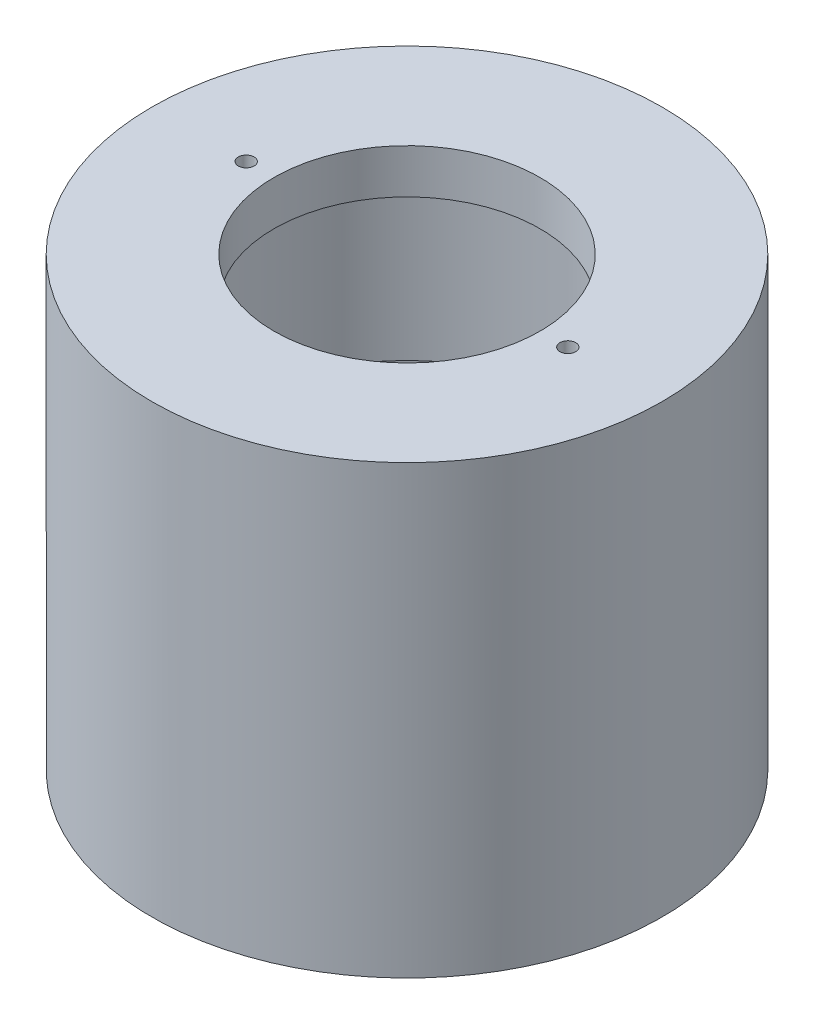
ISO-10303-21;
HEADER;
FILE_DESCRIPTION(('STEP AP214'),'2;1');
FILE_NAME('part.step','',(''),(''),'','','');
FILE_SCHEMA(('AUTOMOTIVE_DESIGN { 1 0 10303 214 1 1 1 1 }'));
ENDSEC;
DATA;
#1=APPLICATION_CONTEXT('core data for automotive mechanical design processes');
#2=APPLICATION_PROTOCOL_DEFINITION('international standard','automotive_design',2000,#1);
#3=PRODUCT_CONTEXT('',#1,'mechanical');
#4=PRODUCT('Part','Part','',(#3));
#5=PRODUCT_RELATED_PRODUCT_CATEGORY('part','',(#4));
#6=PRODUCT_DEFINITION_FORMATION('','',#4);
#7=PRODUCT_DEFINITION_CONTEXT('part definition',#1,'design');
#8=PRODUCT_DEFINITION('design','',#6,#7);
#9=PRODUCT_DEFINITION_SHAPE('','',#8);
#10=(LENGTH_UNIT() NAMED_UNIT(*) SI_UNIT(.MILLI.,.METRE.));
#11=(NAMED_UNIT(*) PLANE_ANGLE_UNIT() SI_UNIT($,.RADIAN.));
#12=(NAMED_UNIT(*) SI_UNIT($,.STERADIAN.) SOLID_ANGLE_UNIT());
#13=UNCERTAINTY_MEASURE_WITH_UNIT(LENGTH_MEASURE(1.E-05),#10,'distance_accuracy_value','');
#14=(GEOMETRIC_REPRESENTATION_CONTEXT(3) GLOBAL_UNCERTAINTY_ASSIGNED_CONTEXT((#13)) GLOBAL_UNIT_ASSIGNED_CONTEXT((#10,
#11,#12)) REPRESENTATION_CONTEXT('',''));
#15=CARTESIAN_POINT('',(0.,0.,0.));
#16=DIRECTION('',(0.,0.,1.));
#17=DIRECTION('',(1.,0.,0.));
#18=AXIS2_PLACEMENT_3D('',#15,#16,#17);
#19=CARTESIAN_POINT('',(0.,145.727689271226,0.));
#20=DIRECTION('',(0.,-1.,0.));
#21=DIRECTION('',(0.,0.,-1.));
#22=AXIS2_PLACEMENT_3D('',#19,#20,#21);
#23=CYLINDRICAL_SURFACE('',#22,25.4);
#24=CARTESIAN_POINT('',(0.,51.435,0.));
#25=DIRECTION('',(0.,1.,0.));
#26=DIRECTION('',(0.,0.,1.));
#27=AXIS2_PLACEMENT_3D('',#24,#25,#26);
#28=CIRCLE('',#27,25.4);
#29=CARTESIAN_POINT('',(0.,51.435,-25.4));
#30=VERTEX_POINT('',#29);
#31=EDGE_CURVE('E86',#30,#30,#28,.F.);
#32=CARTESIAN_POINT('',(0.,26.67,0.));
#33=DIRECTION('',(0.,-1.,0.));
#34=DIRECTION('',(0.,0.,-1.));
#35=AXIS2_PLACEMENT_3D('',#32,#33,#34);
#36=CIRCLE('',#35,25.4);
#37=CARTESIAN_POINT('',(0.,26.67,-25.4));
#38=VERTEX_POINT('',#37);
#39=EDGE_CURVE('E57',#38,#38,#36,.F.);
#40=CARTESIAN_POINT('',(0.,51.435,-25.4));
#41=CARTESIAN_POINT('',(0.,51.17703125,-25.4));
#42=CARTESIAN_POINT('',(0.,50.9190625,-25.4));
#43=CARTESIAN_POINT('',(0.,50.403125,-25.4));
#44=CARTESIAN_POINT('',(0.,50.14515625,-25.4));
#45=CARTESIAN_POINT('',(0.,49.62921875,-25.4));
#46=CARTESIAN_POINT('',(0.,49.37125,-25.4));
#47=CARTESIAN_POINT('',(0.,48.8553125,-25.4));
#48=CARTESIAN_POINT('',(0.,48.59734375,-25.4));
#49=CARTESIAN_POINT('',(0.,48.08140625,-25.4));
#50=CARTESIAN_POINT('',(0.,47.8234375,-25.4));
#51=CARTESIAN_POINT('',(0.,47.3075,-25.4));
#52=CARTESIAN_POINT('',(0.,47.04953125,-25.4));
#53=CARTESIAN_POINT('',(0.,46.53359375,-25.4));
#54=CARTESIAN_POINT('',(0.,46.275625,-25.4));
#55=CARTESIAN_POINT('',(0.,45.7596875,-25.4));
#56=CARTESIAN_POINT('',(0.,45.50171875,-25.4));
#57=CARTESIAN_POINT('',(0.,44.98578125,-25.4));
#58=CARTESIAN_POINT('',(0.,44.7278125,-25.4));
#59=CARTESIAN_POINT('',(0.,44.211875,-25.4));
#60=CARTESIAN_POINT('',(0.,43.95390625,-25.4));
#61=CARTESIAN_POINT('',(0.,43.43796875,-25.4));
#62=CARTESIAN_POINT('',(0.,43.18,-25.4));
#63=CARTESIAN_POINT('',(0.,42.6640625,-25.4));
#64=CARTESIAN_POINT('',(0.,42.40609375,-25.4));
#65=CARTESIAN_POINT('',(0.,41.89015625,-25.4));
#66=CARTESIAN_POINT('',(0.,41.6321875,-25.4));
#67=CARTESIAN_POINT('',(0.,41.11625,-25.4));
#68=CARTESIAN_POINT('',(0.,40.85828125,-25.4));
#69=CARTESIAN_POINT('',(0.,40.34234375,-25.4));
#70=CARTESIAN_POINT('',(0.,40.084375,-25.4));
#71=CARTESIAN_POINT('',(0.,39.5684375,-25.4));
#72=CARTESIAN_POINT('',(0.,39.31046875,-25.4));
#73=CARTESIAN_POINT('',(0.,38.79453125,-25.4));
#74=CARTESIAN_POINT('',(0.,38.5365625,-25.4));
#75=CARTESIAN_POINT('',(0.,38.020625,-25.4));
#76=CARTESIAN_POINT('',(0.,37.76265625,-25.4));
#77=CARTESIAN_POINT('',(0.,37.24671875,-25.4));
#78=CARTESIAN_POINT('',(0.,36.98875,-25.4));
#79=CARTESIAN_POINT('',(0.,36.4728125,-25.4));
#80=CARTESIAN_POINT('',(0.,36.21484375,-25.4));
#81=CARTESIAN_POINT('',(0.,35.69890625,-25.4));
#82=CARTESIAN_POINT('',(0.,35.4409375,-25.4));
#83=CARTESIAN_POINT('',(0.,34.925,-25.4));
#84=CARTESIAN_POINT('',(0.,34.66703125,-25.4));
#85=CARTESIAN_POINT('',(0.,34.15109375,-25.4));
#86=CARTESIAN_POINT('',(0.,33.893125,-25.4));
#87=CARTESIAN_POINT('',(0.,33.3771875,-25.4));
#88=CARTESIAN_POINT('',(0.,33.11921875,-25.4));
#89=CARTESIAN_POINT('',(0.,32.60328125,-25.4));
#90=CARTESIAN_POINT('',(0.,32.3453125,-25.4));
#91=CARTESIAN_POINT('',(0.,31.829375,-25.4));
#92=CARTESIAN_POINT('',(0.,31.57140625,-25.4));
#93=CARTESIAN_POINT('',(0.,31.05546875,-25.4));
#94=CARTESIAN_POINT('',(0.,30.7975,-25.4));
#95=CARTESIAN_POINT('',(0.,30.2815625,-25.4));
#96=CARTESIAN_POINT('',(0.,30.02359375,-25.4));
#97=CARTESIAN_POINT('',(0.,29.50765625,-25.4));
#98=CARTESIAN_POINT('',(0.,29.2496875,-25.4));
#99=CARTESIAN_POINT('',(0.,28.73375,-25.4));
#100=CARTESIAN_POINT('',(0.,28.47578125,-25.4));
#101=CARTESIAN_POINT('',(0.,27.95984375,-25.4));
#102=CARTESIAN_POINT('',(0.,27.701875,-25.4));
#103=CARTESIAN_POINT('',(0.,27.1859375,-25.4));
#104=CARTESIAN_POINT('',(0.,26.92796875,-25.4));
#105=CARTESIAN_POINT('',(0.,26.67,-25.4));
#106=B_SPLINE_CURVE_WITH_KNOTS('',3,(#40,#41,#42,#43,#44,#45,#46,#47,#48,#49,#50,#51,#52,#53,
#54,#55,#56,#57,#58,#59,#60,#61,#62,#63,#64,#65,#66,#67,#68,#69,#70,#71,#72,#73,#74,#75,#76,#77,
#78,#79,#80,#81,#82,#83,#84,#85,#86,#87,#88,#89,#90,#91,#92,#93,#94,#95,#96,#97,#98,#99,#100,
#101,#102,#103,#104,#105),.UNSPECIFIED.,.F.,.F.,(4,2,2,2,2,2,2,2,2,2,2,2,2,2,2,2,2,2,2,2,2,2,2,
2,2,2,2,2,2,2,2,2,4),(0.,0.773906249999998,1.5478125,2.32171874999999,3.09562499999999,
3.86953125,4.6434375,5.41734375,6.19125,6.96515624999999,7.73906249999999,8.51296874999999,
9.286875,10.06078125,10.8346875,11.60859375,12.3825,13.15640625,13.9303125,14.70421875,
15.478125,16.25203125,17.0259375,17.79984375,18.57375,19.34765625,20.1215625,20.89546875,
21.669375,22.44328125,23.2171875,23.99109375,24.765),.UNSPECIFIED.);
#107=EDGE_CURVE('BSEAM41',#30,#38,#106,.T.);
#108=ORIENTED_EDGE('',*,*,#31,.F.);
#109=ORIENTED_EDGE('',*,*,#39,.F.);
#110=ORIENTED_EDGE('',*,*,#107,.T.);
#111=ORIENTED_EDGE('',*,*,#107,.F.);
#112=EDGE_LOOP('',(#108,#110,#109,#111));
#113=FACE_BOUND('',#112,.T.);
#114=ADVANCED_FACE('F41',(#113),#23,.F.);
#115=CARTESIAN_POINT('',(0.,51.435,0.));
#116=DIRECTION('',(0.,-1.,0.));
#117=DIRECTION('',(0.,0.,-1.));
#118=AXIS2_PLACEMENT_3D('',#115,#116,#117);
#119=CYLINDRICAL_SURFACE('',#118,36.5125);
#120=CARTESIAN_POINT('',(0.,-6.096,0.));
#121=DIRECTION('',(0.,-1.,0.));
#122=DIRECTION('',(0.,0.,-1.));
#123=AXIS2_PLACEMENT_3D('',#120,#121,#122);
#124=CIRCLE('',#123,36.5125);
#125=CARTESIAN_POINT('',(0.,-6.096,-36.5125));
#126=VERTEX_POINT('',#125);
#127=EDGE_CURVE('E49',#126,#126,#124,.T.);
#128=ORIENTED_EDGE('',*,*,#127,.F.);
#129=EDGE_LOOP('',(#128));
#130=FACE_BOUND('',#129,.T.);
#131=CARTESIAN_POINT('',(0.,57.785,0.));
#132=DIRECTION('',(0.,1.,0.));
#133=DIRECTION('',(0.,0.,1.));
#134=AXIS2_PLACEMENT_3D('',#131,#132,#133);
#135=CIRCLE('',#134,36.5125);
#136=CARTESIAN_POINT('',(0.,57.785,36.5125));
#137=VERTEX_POINT('',#136);
#138=EDGE_CURVE('E78',#137,#137,#135,.T.);
#139=ORIENTED_EDGE('',*,*,#138,.F.);
#140=EDGE_LOOP('',(#139));
#141=FACE_BOUND('',#140,.T.);
#142=ADVANCED_FACE('F43',(#130,#141),#119,.T.);
#143=CARTESIAN_POINT('',(0.,51.435,0.));
#144=DIRECTION('',(0.,-1.,0.));
#145=DIRECTION('',(0.,0.,-1.));
#146=AXIS2_PLACEMENT_3D('',#143,#144,#145);
#147=CYLINDRICAL_SURFACE('',#146,33.3375);
#148=CARTESIAN_POINT('',(0.,23.114,0.));
#149=DIRECTION('',(0.,-1.,0.));
#150=DIRECTION('',(0.,0.,-1.));
#151=AXIS2_PLACEMENT_3D('',#148,#149,#150);
#152=CIRCLE('',#151,33.3375);
#153=CARTESIAN_POINT('',(0.,23.114,-33.3375));
#154=VERTEX_POINT('',#153);
#155=EDGE_CURVE('E10',#154,#154,#152,.T.);
#156=ORIENTED_EDGE('',*,*,#155,.F.);
#157=EDGE_LOOP('',(#156));
#158=FACE_BOUND('',#157,.T.);
#159=CARTESIAN_POINT('',(0.,-6.096,0.));
#160=DIRECTION('',(0.,-1.,0.));
#161=DIRECTION('',(0.,0.,-1.));
#162=AXIS2_PLACEMENT_3D('',#159,#160,#161);
#163=CIRCLE('',#162,33.3375);
#164=CARTESIAN_POINT('',(0.,-6.096,-33.3375));
#165=VERTEX_POINT('',#164);
#166=EDGE_CURVE('E54',#165,#165,#163,.T.);
#167=ORIENTED_EDGE('',*,*,#166,.T.);
#168=EDGE_LOOP('',(#167));
#169=FACE_BOUND('',#168,.T.);
#170=ADVANCED_FACE('F91',(#158,#169),#147,.F.);
#171=CARTESIAN_POINT('',(0.,-6.096,0.));
#172=DIRECTION('',(0.,-1.,0.));
#173=DIRECTION('',(0.,0.,-1.));
#174=AXIS2_PLACEMENT_3D('',#171,#172,#173);
#175=PLANE('',#174);
#176=ORIENTED_EDGE('',*,*,#127,.T.);
#177=EDGE_LOOP('',(#176));
#178=FACE_BOUND('',#177,.T.);
#179=ORIENTED_EDGE('',*,*,#166,.F.);
#180=EDGE_LOOP('',(#179));
#181=FACE_BOUND('',#180,.T.);
#182=ADVANCED_FACE('F93',(#178,#181),#175,.T.);
#183=CARTESIAN_POINT('',(0.,24.9428,0.));
#184=DIRECTION('',(0.,-1.,0.));
#185=DIRECTION('',(0.,0.,-1.));
#186=AXIS2_PLACEMENT_3D('',#183,#184,#185);
#187=CIRCLE('',#186,25.4);
#188=CARTESIAN_POINT('',(0.,24.9428,-25.4));
#189=VERTEX_POINT('',#188);
#190=EDGE_CURVE('E45',#189,#189,#187,.F.);
#191=CARTESIAN_POINT('',(0.,23.114,0.));
#192=DIRECTION('',(0.,-1.,0.));
#193=DIRECTION('',(0.,0.,-1.));
#194=AXIS2_PLACEMENT_3D('',#191,#192,#193);
#195=CIRCLE('',#194,25.4);
#196=CARTESIAN_POINT('',(0.,23.114,-25.4));
#197=VERTEX_POINT('',#196);
#198=EDGE_CURVE('E83',#197,#197,#195,.T.);
#199=CARTESIAN_POINT('',(0.,24.9428,-25.4));
#200=CARTESIAN_POINT('',(0.,24.92375,-25.4));
#201=CARTESIAN_POINT('',(0.,24.9047,-25.4));
#202=CARTESIAN_POINT('',(0.,24.8666,-25.4));
#203=CARTESIAN_POINT('',(0.,24.84755,-25.4));
#204=CARTESIAN_POINT('',(0.,24.80945,-25.4));
#205=CARTESIAN_POINT('',(0.,24.7904,-25.4));
#206=CARTESIAN_POINT('',(0.,24.7523,-25.4));
#207=CARTESIAN_POINT('',(0.,24.73325,-25.4));
#208=CARTESIAN_POINT('',(0.,24.69515,-25.4));
#209=CARTESIAN_POINT('',(0.,24.6761,-25.4));
#210=CARTESIAN_POINT('',(0.,24.638,-25.4));
#211=CARTESIAN_POINT('',(0.,24.61895,-25.4));
#212=CARTESIAN_POINT('',(0.,24.58085,-25.4));
#213=CARTESIAN_POINT('',(0.,24.5618,-25.4));
#214=CARTESIAN_POINT('',(0.,24.5237,-25.4));
#215=CARTESIAN_POINT('',(0.,24.50465,-25.4));
#216=CARTESIAN_POINT('',(0.,24.46655,-25.4));
#217=CARTESIAN_POINT('',(0.,24.4475,-25.4));
#218=CARTESIAN_POINT('',(0.,24.4094,-25.4));
#219=CARTESIAN_POINT('',(0.,24.39035,-25.4));
#220=CARTESIAN_POINT('',(0.,24.35225,-25.4));
#221=CARTESIAN_POINT('',(0.,24.3332,-25.4));
#222=CARTESIAN_POINT('',(0.,24.2951,-25.4));
#223=CARTESIAN_POINT('',(0.,24.27605,-25.4));
#224=CARTESIAN_POINT('',(0.,24.23795,-25.4));
#225=CARTESIAN_POINT('',(0.,24.2189,-25.4));
#226=CARTESIAN_POINT('',(0.,24.1808,-25.4));
#227=CARTESIAN_POINT('',(0.,24.16175,-25.4));
#228=CARTESIAN_POINT('',(0.,24.12365,-25.4));
#229=CARTESIAN_POINT('',(0.,24.1046,-25.4));
#230=CARTESIAN_POINT('',(0.,24.0665,-25.4));
#231=CARTESIAN_POINT('',(0.,24.04745,-25.4));
#232=CARTESIAN_POINT('',(0.,24.00935,-25.4));
#233=CARTESIAN_POINT('',(0.,23.9903,-25.4));
#234=CARTESIAN_POINT('',(0.,23.9522,-25.4));
#235=CARTESIAN_POINT('',(0.,23.93315,-25.4));
#236=CARTESIAN_POINT('',(0.,23.89505,-25.4));
#237=CARTESIAN_POINT('',(0.,23.876,-25.4));
#238=CARTESIAN_POINT('',(0.,23.8379,-25.4));
#239=CARTESIAN_POINT('',(0.,23.81885,-25.4));
#240=CARTESIAN_POINT('',(0.,23.78075,-25.4));
#241=CARTESIAN_POINT('',(0.,23.7617,-25.4));
#242=CARTESIAN_POINT('',(0.,23.7236,-25.4));
#243=CARTESIAN_POINT('',(0.,23.70455,-25.4));
#244=CARTESIAN_POINT('',(0.,23.66645,-25.4));
#245=CARTESIAN_POINT('',(0.,23.6474,-25.4));
#246=CARTESIAN_POINT('',(0.,23.6093,-25.4));
#247=CARTESIAN_POINT('',(0.,23.59025,-25.4));
#248=CARTESIAN_POINT('',(0.,23.55215,-25.4));
#249=CARTESIAN_POINT('',(0.,23.5331,-25.4));
#250=CARTESIAN_POINT('',(0.,23.495,-25.4));
#251=CARTESIAN_POINT('',(0.,23.47595,-25.4));
#252=CARTESIAN_POINT('',(0.,23.43785,-25.4));
#253=CARTESIAN_POINT('',(0.,23.4188,-25.4));
#254=CARTESIAN_POINT('',(0.,23.3807,-25.4));
#255=CARTESIAN_POINT('',(0.,23.36165,-25.4));
#256=CARTESIAN_POINT('',(0.,23.32355,-25.4));
#257=CARTESIAN_POINT('',(0.,23.3045,-25.4));
#258=CARTESIAN_POINT('',(0.,23.2664,-25.4));
#259=CARTESIAN_POINT('',(0.,23.24735,-25.4));
#260=CARTESIAN_POINT('',(0.,23.20925,-25.4));
#261=CARTESIAN_POINT('',(0.,23.1902,-25.4));
#262=CARTESIAN_POINT('',(0.,23.1521,-25.4));
#263=CARTESIAN_POINT('',(0.,23.13305,-25.4));
#264=CARTESIAN_POINT('',(0.,23.114,-25.4));
#265=B_SPLINE_CURVE_WITH_KNOTS('',3,(#199,#200,#201,#202,#203,#204,#205,#206,#207,#208,#209,
#210,#211,#212,#213,#214,#215,#216,#217,#218,#219,#220,#221,#222,#223,#224,#225,#226,#227,#228,
#229,#230,#231,#232,#233,#234,#235,#236,#237,#238,#239,#240,#241,#242,#243,#244,#245,#246,#247,
#248,#249,#250,#251,#252,#253,#254,#255,#256,#257,#258,#259,#260,#261,#262,#263,#264),
.UNSPECIFIED.,.F.,.F.,(4,2,2,2,2,2,2,2,2,2,2,2,2,2,2,2,2,2,2,2,2,2,2,2,2,2,2,2,2,2,2,2,4),(0.,
0.0571500000000058,0.114299999999998,0.171450000000004,0.228599999999995,0.285750000000001,
0.342899999999993,0.400049999999999,0.457199999999991,0.514349999999997,0.571500000000003,
0.628649999999994,0.6858,0.742949999999992,0.800099999999998,0.85724999999999,0.914399999999996,
0.971550000000002,1.02869999999999,1.08585,1.14299999999999,1.20015,1.25729999999999,
1.31444999999999,1.3716,1.42874999999999,1.4859,1.54304999999999,1.6002,1.65734999999999,
1.71449999999999,1.77164999999999,1.82879999999999),.UNSPECIFIED.);
#266=EDGE_CURVE('BSEAM95',#189,#197,#265,.T.);
#267=ORIENTED_EDGE('',*,*,#190,.T.);
#268=ORIENTED_EDGE('',*,*,#198,.T.);
#269=ORIENTED_EDGE('',*,*,#266,.T.);
#270=ORIENTED_EDGE('',*,*,#266,.F.);
#271=EDGE_LOOP('',(#267,#269,#268,#270));
#272=FACE_BOUND('',#271,.T.);
#273=ADVANCED_FACE('F95',(#272),#23,.F.);
#274=CARTESIAN_POINT('',(0.,23.114,0.));
#275=DIRECTION('',(0.,-1.,0.));
#276=DIRECTION('',(0.,0.,-1.));
#277=AXIS2_PLACEMENT_3D('',#274,#275,#276);
#278=PLANE('',#277);
#279=ORIENTED_EDGE('',*,*,#198,.F.);
#280=EDGE_LOOP('',(#279));
#281=FACE_BOUND('',#280,.T.);
#282=ORIENTED_EDGE('',*,*,#155,.T.);
#283=EDGE_LOOP('',(#282));
#284=FACE_BOUND('',#283,.T.);
#285=ADVANCED_FACE('F102',(#281,#284),#278,.T.);
#286=CARTESIAN_POINT('',(0.,51.435,0.));
#287=DIRECTION('',(0.,1.,0.));
#288=DIRECTION('',(0.,0.,1.));
#289=AXIS2_PLACEMENT_3D('',#286,#287,#288);
#290=PLANE('',#289);
#291=CARTESIAN_POINT('',(23.0124,51.435,0.));
#292=DIRECTION('',(0.,1.,0.));
#293=DIRECTION('',(0.,0.,1.));
#294=AXIS2_PLACEMENT_3D('',#291,#292,#293);
#295=CIRCLE('',#294,1.1303);
#296=CARTESIAN_POINT('',(23.0124,51.435,1.1303));
#297=VERTEX_POINT('',#296);
#298=EDGE_CURVE('E156',#297,#297,#295,.T.);
#299=ORIENTED_EDGE('',*,*,#298,.T.);
#300=EDGE_LOOP('',(#299));
#301=FACE_BOUND('',#300,.T.);
#302=CARTESIAN_POINT('',(-23.0124,51.435,0.));
#303=DIRECTION('',(0.,1.,0.));
#304=DIRECTION('',(0.,0.,1.));
#305=AXIS2_PLACEMENT_3D('',#302,#303,#304);
#306=CIRCLE('',#305,1.1303);
#307=CARTESIAN_POINT('',(-23.0124,51.435,1.1303));
#308=VERTEX_POINT('',#307);
#309=EDGE_CURVE('E70',#308,#308,#306,.T.);
#310=ORIENTED_EDGE('',*,*,#309,.T.);
#311=EDGE_LOOP('',(#310));
#312=FACE_BOUND('',#311,.T.);
#313=CARTESIAN_POINT('',(0.,51.435,0.));
#314=DIRECTION('',(0.,1.,0.));
#315=DIRECTION('',(0.,0.,1.));
#316=AXIS2_PLACEMENT_3D('',#313,#314,#315);
#317=CIRCLE('',#316,19.05);
#318=CARTESIAN_POINT('',(0.,51.435,19.05));
#319=VERTEX_POINT('',#318);
#320=EDGE_CURVE('E63',#319,#319,#317,.T.);
#321=ORIENTED_EDGE('',*,*,#320,.T.);
#322=EDGE_LOOP('',(#321));
#323=FACE_BOUND('',#322,.T.);
#324=ORIENTED_EDGE('',*,*,#31,.T.);
#325=EDGE_LOOP('',(#324));
#326=FACE_BOUND('',#325,.T.);
#327=ADVANCED_FACE('F117',(#301,#312,#323,#326),#290,.F.);
#328=CARTESIAN_POINT('',(0.,57.785,0.));
#329=DIRECTION('',(0.,1.,0.));
#330=DIRECTION('',(0.,0.,1.));
#331=AXIS2_PLACEMENT_3D('',#328,#329,#330);
#332=PLANE('',#331);
#333=CARTESIAN_POINT('',(23.0124,57.785,0.));
#334=DIRECTION('',(0.,1.,0.));
#335=DIRECTION('',(0.,0.,1.));
#336=AXIS2_PLACEMENT_3D('',#333,#334,#335);
#337=CIRCLE('',#336,1.1303);
#338=CARTESIAN_POINT('',(23.0124,57.785,1.1303));
#339=VERTEX_POINT('',#338);
#340=EDGE_CURVE('E153',#339,#339,#337,.T.);
#341=ORIENTED_EDGE('',*,*,#340,.F.);
#342=EDGE_LOOP('',(#341));
#343=FACE_BOUND('',#342,.T.);
#344=CARTESIAN_POINT('',(-23.0124,57.785,0.));
#345=DIRECTION('',(0.,1.,0.));
#346=DIRECTION('',(0.,0.,1.));
#347=AXIS2_PLACEMENT_3D('',#344,#345,#346);
#348=CIRCLE('',#347,1.1303);
#349=CARTESIAN_POINT('',(-23.0124,57.785,1.1303));
#350=VERTEX_POINT('',#349);
#351=EDGE_CURVE('E157',#350,#350,#348,.T.);
#352=ORIENTED_EDGE('',*,*,#351,.F.);
#353=EDGE_LOOP('',(#352));
#354=FACE_BOUND('',#353,.T.);
#355=ORIENTED_EDGE('',*,*,#138,.T.);
#356=EDGE_LOOP('',(#355));
#357=FACE_BOUND('',#356,.T.);
#358=CARTESIAN_POINT('',(0.,57.785,0.));
#359=DIRECTION('',(0.,1.,0.));
#360=DIRECTION('',(0.,0.,1.));
#361=AXIS2_PLACEMENT_3D('',#358,#359,#360);
#362=CIRCLE('',#361,19.05);
#363=CARTESIAN_POINT('',(0.,57.785,19.05));
#364=VERTEX_POINT('',#363);
#365=EDGE_CURVE('E75',#364,#364,#362,.T.);
#366=ORIENTED_EDGE('',*,*,#365,.F.);
#367=EDGE_LOOP('',(#366));
#368=FACE_BOUND('',#367,.T.);
#369=ADVANCED_FACE('F121',(#343,#354,#357,#368),#332,.T.);
#370=CARTESIAN_POINT('',(0.,57.785,0.));
#371=DIRECTION('',(0.,-1.,0.));
#372=DIRECTION('',(0.,0.,-1.));
#373=AXIS2_PLACEMENT_3D('',#370,#371,#372);
#374=CYLINDRICAL_SURFACE('',#373,19.05);
#375=ORIENTED_EDGE('',*,*,#365,.T.);
#376=EDGE_LOOP('',(#375));
#377=FACE_BOUND('',#376,.T.);
#378=ORIENTED_EDGE('',*,*,#320,.F.);
#379=EDGE_LOOP('',(#378));
#380=FACE_BOUND('',#379,.T.);
#381=ADVANCED_FACE('F125',(#377,#380),#374,.F.);
#382=CARTESIAN_POINT('',(0.,24.9428,0.));
#383=DIRECTION('',(0.,-1.,0.));
#384=DIRECTION('',(0.,0.,-1.));
#385=AXIS2_PLACEMENT_3D('',#382,#383,#384);
#386=PLANE('',#385);
#387=CARTESIAN_POINT('',(0.,24.9428,0.));
#388=DIRECTION('',(0.,-1.,0.));
#389=DIRECTION('',(0.,0.,-1.));
#390=AXIS2_PLACEMENT_3D('',#387,#388,#389);
#391=CIRCLE('',#390,26.9494);
#392=CARTESIAN_POINT('',(0.,24.9428,-26.9494));
#393=VERTEX_POINT('',#392);
#394=EDGE_CURVE('E59',#393,#393,#391,.T.);
#395=ORIENTED_EDGE('',*,*,#394,.F.);
#396=EDGE_LOOP('',(#395));
#397=FACE_BOUND('',#396,.T.);
#398=ORIENTED_EDGE('',*,*,#190,.F.);
#399=EDGE_LOOP('',(#398));
#400=FACE_BOUND('',#399,.T.);
#401=ADVANCED_FACE('F129',(#397,#400),#386,.F.);
#402=CARTESIAN_POINT('',(0.,26.67,0.));
#403=DIRECTION('',(0.,-1.,0.));
#404=DIRECTION('',(0.,0.,-1.));
#405=AXIS2_PLACEMENT_3D('',#402,#403,#404);
#406=PLANE('',#405);
#407=CARTESIAN_POINT('',(0.,26.67,0.));
#408=DIRECTION('',(0.,-1.,0.));
#409=DIRECTION('',(0.,0.,-1.));
#410=AXIS2_PLACEMENT_3D('',#407,#408,#409);
#411=CIRCLE('',#410,26.9494);
#412=CARTESIAN_POINT('',(0.,26.67,-26.9494));
#413=VERTEX_POINT('',#412);
#414=EDGE_CURVE('E65',#413,#413,#411,.T.);
#415=ORIENTED_EDGE('',*,*,#414,.T.);
#416=EDGE_LOOP('',(#415));
#417=FACE_BOUND('',#416,.T.);
#418=ORIENTED_EDGE('',*,*,#39,.T.);
#419=EDGE_LOOP('',(#418));
#420=FACE_BOUND('',#419,.T.);
#421=ADVANCED_FACE('F135',(#417,#420),#406,.T.);
#422=CARTESIAN_POINT('',(0.,24.9428,0.));
#423=DIRECTION('',(0.,1.,0.));
#424=DIRECTION('',(0.,0.,1.));
#425=AXIS2_PLACEMENT_3D('',#422,#423,#424);
#426=CYLINDRICAL_SURFACE('',#425,26.9494);
#427=ORIENTED_EDGE('',*,*,#394,.T.);
#428=EDGE_LOOP('',(#427));
#429=FACE_BOUND('',#428,.T.);
#430=ORIENTED_EDGE('',*,*,#414,.F.);
#431=EDGE_LOOP('',(#430));
#432=FACE_BOUND('',#431,.T.);
#433=ADVANCED_FACE('F131',(#429,#432),#426,.F.);
#434=CARTESIAN_POINT('',(-23.0124,-6.096,0.));
#435=DIRECTION('',(0.,1.,0.));
#436=DIRECTION('',(0.,0.,1.));
#437=AXIS2_PLACEMENT_3D('',#434,#435,#436);
#438=CYLINDRICAL_SURFACE('',#437,1.1303);
#439=ORIENTED_EDGE('',*,*,#351,.T.);
#440=EDGE_LOOP('',(#439));
#441=FACE_BOUND('',#440,.T.);
#442=ORIENTED_EDGE('',*,*,#309,.F.);
#443=EDGE_LOOP('',(#442));
#444=FACE_BOUND('',#443,.T.);
#445=ADVANCED_FACE('F134',(#441,#444),#438,.F.);
#446=CARTESIAN_POINT('',(23.0124,-6.096,0.));
#447=DIRECTION('',(0.,1.,0.));
#448=DIRECTION('',(0.,0.,1.));
#449=AXIS2_PLACEMENT_3D('',#446,#447,#448);
#450=CYLINDRICAL_SURFACE('',#449,1.1303);
#451=ORIENTED_EDGE('',*,*,#340,.T.);
#452=EDGE_LOOP('',(#451));
#453=FACE_BOUND('',#452,.T.);
#454=ORIENTED_EDGE('',*,*,#298,.F.);
#455=EDGE_LOOP('',(#454));
#456=FACE_BOUND('',#455,.T.);
#457=ADVANCED_FACE('F144',(#453,#456),#450,.F.);
#458=CLOSED_SHELL('',(#114,#142,#170,#182,#273,#285,#327,#369,#381,#401,#421,#433,#445,#457));
#459=MANIFOLD_SOLID_BREP('B2',#458);
#460=ADVANCED_BREP_SHAPE_REPRESENTATION('',(#18,#459),#14);
#461=SHAPE_DEFINITION_REPRESENTATION(#9,#460);
ENDSEC;
END-ISO-10303-21;
